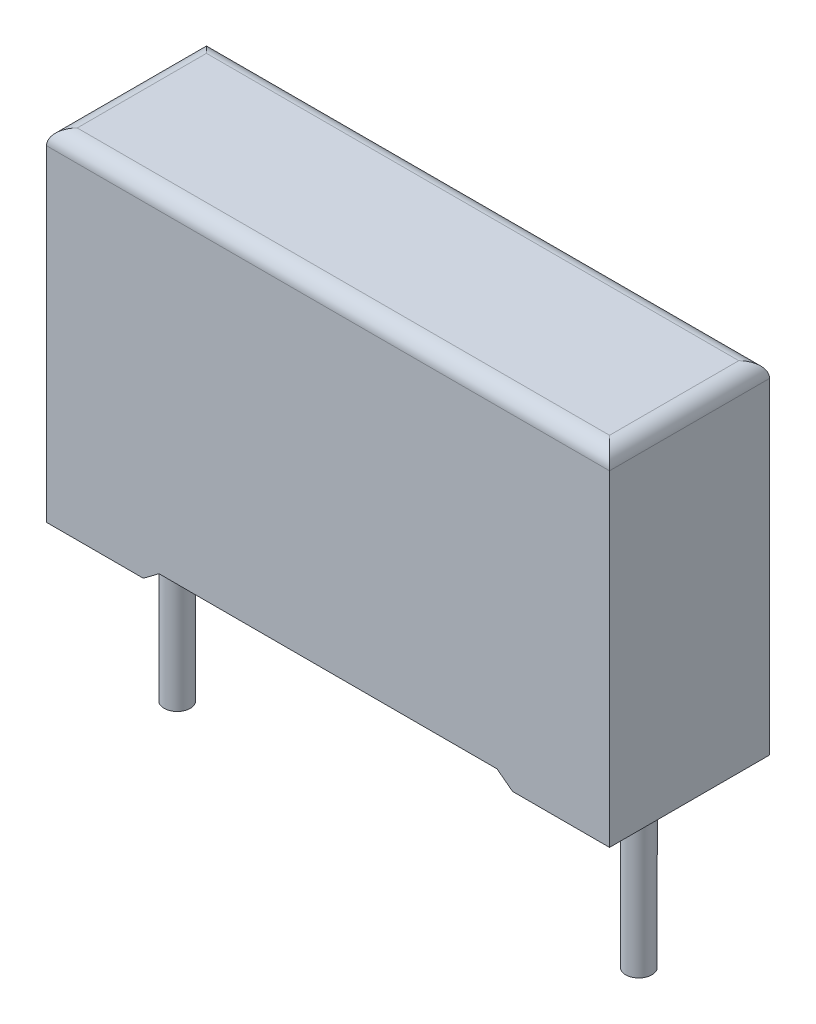
ISO-10303-21;
HEADER;
FILE_DESCRIPTION(('STEP AP214'),'2;1');
FILE_NAME('part.step','',(''),(''),'','','');
FILE_SCHEMA(('AUTOMOTIVE_DESIGN { 1 0 10303 214 1 1 1 1 }'));
ENDSEC;
DATA;
#1=APPLICATION_CONTEXT('core data for automotive mechanical design processes');
#2=APPLICATION_PROTOCOL_DEFINITION('international standard','automotive_design',2000,#1);
#3=PRODUCT_CONTEXT('',#1,'mechanical');
#4=PRODUCT('Part','Part','',(#3));
#5=PRODUCT_RELATED_PRODUCT_CATEGORY('part','',(#4));
#6=PRODUCT_DEFINITION_FORMATION('','',#4);
#7=PRODUCT_DEFINITION_CONTEXT('part definition',#1,'design');
#8=PRODUCT_DEFINITION('design','',#6,#7);
#9=PRODUCT_DEFINITION_SHAPE('','',#8);
#10=(LENGTH_UNIT() NAMED_UNIT(*) SI_UNIT(.MILLI.,.METRE.));
#11=(NAMED_UNIT(*) PLANE_ANGLE_UNIT() SI_UNIT($,.RADIAN.));
#12=(NAMED_UNIT(*) SI_UNIT($,.STERADIAN.) SOLID_ANGLE_UNIT());
#13=UNCERTAINTY_MEASURE_WITH_UNIT(LENGTH_MEASURE(1.E-05),#10,'distance_accuracy_value','');
#14=(GEOMETRIC_REPRESENTATION_CONTEXT(3) GLOBAL_UNCERTAINTY_ASSIGNED_CONTEXT((#13)) GLOBAL_UNIT_ASSIGNED_CONTEXT((#10,
#11,#12)) REPRESENTATION_CONTEXT('',''));
#15=CARTESIAN_POINT('',(0.,0.,0.));
#16=DIRECTION('',(0.,0.,1.));
#17=DIRECTION('',(1.,0.,0.));
#18=AXIS2_PLACEMENT_3D('',#15,#16,#17);
#19=CARTESIAN_POINT('',(16.65,-5.5,2.6));
#20=DIRECTION('',(0.,1.,0.));
#21=DIRECTION('',(0.,0.,1.));
#22=AXIS2_PLACEMENT_3D('',#19,#20,#21);
#23=CYLINDRICAL_SURFACE('',#22,0.425);
#24=CARTESIAN_POINT('',(16.65,-5.5,2.6));
#25=DIRECTION('',(0.,1.,0.));
#26=DIRECTION('',(0.,0.,-1.));
#27=AXIS2_PLACEMENT_3D('',#24,#25,#26);
#28=CIRCLE('',#27,0.425);
#29=CARTESIAN_POINT('',(16.65,-5.5,2.175));
#30=VERTEX_POINT('',#29);
#31=EDGE_CURVE('E11',#30,#30,#28,.T.);
#32=ORIENTED_EDGE('',*,*,#31,.T.);
#33=EDGE_LOOP('',(#32));
#34=FACE_BOUND('',#33,.T.);
#35=CARTESIAN_POINT('',(16.65,0.75,2.6));
#36=DIRECTION('',(0.,-1.,0.));
#37=DIRECTION('',(0.,0.,-1.));
#38=AXIS2_PLACEMENT_3D('',#35,#36,#37);
#39=CIRCLE('',#38,0.425);
#40=CARTESIAN_POINT('',(16.65,0.75,3.025));
#41=VERTEX_POINT('',#40);
#42=EDGE_CURVE('E28',#41,#41,#39,.T.);
#43=ORIENTED_EDGE('',*,*,#42,.T.);
#44=EDGE_LOOP('',(#43));
#45=FACE_BOUND('',#44,.T.);
#46=ADVANCED_FACE('F17',(#34,#45),#23,.T.);
#47=CARTESIAN_POINT('',(1.65,-5.5,2.6));
#48=DIRECTION('',(0.,1.,0.));
#49=DIRECTION('',(0.,0.,1.));
#50=AXIS2_PLACEMENT_3D('',#47,#48,#49);
#51=CYLINDRICAL_SURFACE('',#50,0.425);
#52=CARTESIAN_POINT('',(1.65,-5.5,2.6));
#53=DIRECTION('',(0.,-1.,0.));
#54=DIRECTION('',(0.,0.,-1.));
#55=AXIS2_PLACEMENT_3D('',#52,#53,#54);
#56=CIRCLE('',#55,0.425);
#57=CARTESIAN_POINT('',(1.65,-5.5,3.025));
#58=VERTEX_POINT('',#57);
#59=EDGE_CURVE('E357',#58,#58,#56,.T.);
#60=ORIENTED_EDGE('',*,*,#59,.F.);
#61=EDGE_LOOP('',(#60));
#62=FACE_BOUND('',#61,.T.);
#63=CARTESIAN_POINT('',(1.65,0.75,2.6));
#64=DIRECTION('',(0.,-1.,0.));
#65=DIRECTION('',(0.,0.,-1.));
#66=AXIS2_PLACEMENT_3D('',#63,#64,#65);
#67=CIRCLE('',#66,0.425);
#68=CARTESIAN_POINT('',(1.65,0.75,3.025));
#69=VERTEX_POINT('',#68);
#70=EDGE_CURVE('E21',#69,#69,#67,.T.);
#71=ORIENTED_EDGE('',*,*,#70,.T.);
#72=EDGE_LOOP('',(#71));
#73=FACE_BOUND('',#72,.T.);
#74=ADVANCED_FACE('F532',(#62,#73),#51,.T.);
#75=CARTESIAN_POINT('',(0.,0.,5.2));
#76=DIRECTION('',(0.,1.,0.));
#77=DIRECTION('',(1.,0.,0.));
#78=AXIS2_PLACEMENT_3D('',#75,#76,#77);
#79=PLANE('',#78);
#80=DIRECTION('',(0.,0.,1.));
#81=VECTOR('',#80,1.);
#82=CARTESIAN_POINT('',(15.15,0.,0.));
#83=LINE('',#82,#81);
#84=CARTESIAN_POINT('',(15.15,0.,0.));
#85=VERTEX_POINT('',#84);
#86=CARTESIAN_POINT('',(15.15,0.,0.609999939));
#87=VERTEX_POINT('',#86);
#88=EDGE_CURVE('E259',#85,#87,#83,.T.);
#89=ORIENTED_EDGE('',*,*,#88,.F.);
#90=DIRECTION('',(1.,0.,0.));
#91=VECTOR('',#90,1.);
#92=CARTESIAN_POINT('',(0.,0.,0.));
#93=LINE('',#92,#91);
#94=CARTESIAN_POINT('',(18.3,0.,0.));
#95=VERTEX_POINT('',#94);
#96=EDGE_CURVE('E309',#85,#95,#93,.T.);
#97=ORIENTED_EDGE('',*,*,#96,.T.);
#98=DIRECTION('',(0.,0.,-1.));
#99=VECTOR('',#98,1.);
#100=CARTESIAN_POINT('',(18.3,0.,5.2));
#101=LINE('',#100,#99);
#102=CARTESIAN_POINT('',(18.3,0.,5.2));
#103=VERTEX_POINT('',#102);
#104=EDGE_CURVE('E242',#103,#95,#101,.T.);
#105=ORIENTED_EDGE('',*,*,#104,.F.);
#106=DIRECTION('',(1.,0.,0.));
#107=VECTOR('',#106,1.);
#108=CARTESIAN_POINT('',(0.,0.,5.2));
#109=LINE('',#108,#107);
#110=CARTESIAN_POINT('',(15.15,0.,5.2));
#111=VERTEX_POINT('',#110);
#112=EDGE_CURVE('E169',#111,#103,#109,.T.);
#113=ORIENTED_EDGE('',*,*,#112,.F.);
#114=DIRECTION('',(0.,0.,1.));
#115=VECTOR('',#114,1.);
#116=CARTESIAN_POINT('',(15.15,0.,0.));
#117=LINE('',#116,#115);
#118=CARTESIAN_POINT('',(15.15,0.,4.590000061));
#119=VERTEX_POINT('',#118);
#120=EDGE_CURVE('E224',#119,#111,#117,.T.);
#121=ORIENTED_EDGE('',*,*,#120,.F.);
#122=DIRECTION('',(-1.,0.,0.));
#123=VECTOR('',#122,1.);
#124=CARTESIAN_POINT('',(17.690000061,0.,4.590000061));
#125=LINE('',#124,#123);
#126=CARTESIAN_POINT('',(17.690000061,0.,4.590000061));
#127=VERTEX_POINT('',#126);
#128=EDGE_CURVE('E272',#127,#119,#125,.T.);
#129=ORIENTED_EDGE('',*,*,#128,.F.);
#130=DIRECTION('',(0.,0.,1.));
#131=VECTOR('',#130,1.);
#132=CARTESIAN_POINT('',(17.690000061,0.,0.609999939));
#133=LINE('',#132,#131);
#134=CARTESIAN_POINT('',(17.690000061,0.,0.609999939));
#135=VERTEX_POINT('',#134);
#136=EDGE_CURVE('E215',#135,#127,#133,.T.);
#137=ORIENTED_EDGE('',*,*,#136,.F.);
#138=DIRECTION('',(1.,0.,0.));
#139=VECTOR('',#138,1.);
#140=CARTESIAN_POINT('',(0.609999939,0.,0.609999939));
#141=LINE('',#140,#139);
#142=EDGE_CURVE('E253',#87,#135,#141,.T.);
#143=ORIENTED_EDGE('',*,*,#142,.F.);
#144=EDGE_LOOP('',(#89,#97,#105,#113,#121,#129,#137,#143));
#145=FACE_BOUND('',#144,.T.);
#146=ADVANCED_FACE('F488',(#145),#79,.F.);
#147=CARTESIAN_POINT('',(0.,0.,5.2));
#148=DIRECTION('',(0.,0.,-1.));
#149=DIRECTION('',(0.,-1.,0.));
#150=AXIS2_PLACEMENT_3D('',#147,#148,#149);
#151=PLANE('',#150);
#152=DIRECTION('',(0.,1.,0.));
#153=VECTOR('',#152,1.);
#154=CARTESIAN_POINT('',(18.3,0.,5.2));
#155=LINE('',#154,#153);
#156=CARTESIAN_POINT('',(18.3,10.6,5.2));
#157=VERTEX_POINT('',#156);
#158=EDGE_CURVE('E295',#103,#157,#155,.T.);
#159=ORIENTED_EDGE('',*,*,#158,.T.);
#160=DIRECTION('',(-1.,0.,0.));
#161=VECTOR('',#160,1.);
#162=CARTESIAN_POINT('',(0.,10.6,5.2));
#163=LINE('',#162,#161);
#164=CARTESIAN_POINT('',(0.,10.6,5.2));
#165=VERTEX_POINT('',#164);
#166=EDGE_CURVE('E301',#157,#165,#163,.T.);
#167=ORIENTED_EDGE('',*,*,#166,.T.);
#168=DIRECTION('',(0.,-1.,0.));
#169=VECTOR('',#168,1.);
#170=CARTESIAN_POINT('',(0.,0.,5.2));
#171=LINE('',#170,#169);
#172=CARTESIAN_POINT('',(0.,0.,5.2));
#173=VERTEX_POINT('',#172);
#174=EDGE_CURVE('E153',#165,#173,#171,.T.);
#175=ORIENTED_EDGE('',*,*,#174,.T.);
#176=DIRECTION('',(1.,0.,0.));
#177=VECTOR('',#176,1.);
#178=CARTESIAN_POINT('',(0.,0.,5.2));
#179=LINE('',#178,#177);
#180=CARTESIAN_POINT('',(3.15,0.,5.2));
#181=VERTEX_POINT('',#180);
#182=EDGE_CURVE('E205',#173,#181,#179,.T.);
#183=ORIENTED_EDGE('',*,*,#182,.T.);
#184=DIRECTION('',(-0.798802732587283,-0.601593047176486,0.));
#185=VECTOR('',#184,1.);
#186=CARTESIAN_POINT('',(3.15,0.,5.2));
#187=LINE('',#186,#185);
#188=CARTESIAN_POINT('',(3.658191,0.382728,5.2));
#189=VERTEX_POINT('',#188);
#190=EDGE_CURVE('E230',#189,#181,#187,.T.);
#191=ORIENTED_EDGE('',*,*,#190,.F.);
#192=DIRECTION('',(-1.,0.,0.));
#193=VECTOR('',#192,1.);
#194=CARTESIAN_POINT('',(9.15,0.382728,5.2));
#195=LINE('',#194,#193);
#196=CARTESIAN_POINT('',(14.641809,0.382728,5.2));
#197=VERTEX_POINT('',#196);
#198=EDGE_CURVE('E231',#197,#189,#195,.T.);
#199=ORIENTED_EDGE('',*,*,#198,.F.);
#200=DIRECTION('',(0.798802732587283,-0.601593047176486,0.));
#201=VECTOR('',#200,1.);
#202=CARTESIAN_POINT('',(15.15,0.,5.2));
#203=LINE('',#202,#201);
#204=EDGE_CURVE('E209',#197,#111,#203,.T.);
#205=ORIENTED_EDGE('',*,*,#204,.T.);
#206=ORIENTED_EDGE('',*,*,#112,.T.);
#207=EDGE_LOOP('',(#159,#167,#175,#183,#191,#199,#205,#206));
#208=FACE_BOUND('',#207,.T.);
#209=ADVANCED_FACE('F306',(#208),#151,.F.);
#210=CARTESIAN_POINT('',(0.,0.,0.));
#211=DIRECTION('',(0.,0.,-1.));
#212=DIRECTION('',(0.,-1.,0.));
#213=AXIS2_PLACEMENT_3D('',#210,#211,#212);
#214=PLANE('',#213);
#215=DIRECTION('',(0.,-1.,0.));
#216=VECTOR('',#215,1.);
#217=CARTESIAN_POINT('',(0.,0.,0.));
#218=LINE('',#217,#216);
#219=CARTESIAN_POINT('',(0.,10.6,0.));
#220=VERTEX_POINT('',#219);
#221=CARTESIAN_POINT('',(0.,0.,0.));
#222=VERTEX_POINT('',#221);
#223=EDGE_CURVE('E133',#220,#222,#218,.T.);
#224=ORIENTED_EDGE('',*,*,#223,.F.);
#225=DIRECTION('',(1.,0.,0.));
#226=VECTOR('',#225,1.);
#227=CARTESIAN_POINT('',(18.3,10.6,0.));
#228=LINE('',#227,#226);
#229=CARTESIAN_POINT('',(18.3,10.6,0.));
#230=VERTEX_POINT('',#229);
#231=EDGE_CURVE('E138',#220,#230,#228,.T.);
#232=ORIENTED_EDGE('',*,*,#231,.T.);
#233=DIRECTION('',(0.,1.,0.));
#234=VECTOR('',#233,1.);
#235=CARTESIAN_POINT('',(18.3,0.,0.));
#236=LINE('',#235,#234);
#237=EDGE_CURVE('E148',#95,#230,#236,.T.);
#238=ORIENTED_EDGE('',*,*,#237,.F.);
#239=ORIENTED_EDGE('',*,*,#96,.F.);
#240=DIRECTION('',(0.798802732587283,-0.601593047176486,0.));
#241=VECTOR('',#240,1.);
#242=CARTESIAN_POINT('',(15.15,0.,0.));
#243=LINE('',#242,#241);
#244=CARTESIAN_POINT('',(14.641809,0.382728,0.));
#245=VERTEX_POINT('',#244);
#246=EDGE_CURVE('E225',#245,#85,#243,.T.);
#247=ORIENTED_EDGE('',*,*,#246,.F.);
#248=DIRECTION('',(-1.,0.,0.));
#249=VECTOR('',#248,1.);
#250=CARTESIAN_POINT('',(9.15,0.382728,0.));
#251=LINE('',#250,#249);
#252=CARTESIAN_POINT('',(3.658191,0.382728,0.));
#253=VERTEX_POINT('',#252);
#254=EDGE_CURVE('E170',#245,#253,#251,.T.);
#255=ORIENTED_EDGE('',*,*,#254,.T.);
#256=DIRECTION('',(-0.798802732587283,-0.601593047176486,0.));
#257=VECTOR('',#256,1.);
#258=CARTESIAN_POINT('',(3.15,0.,0.));
#259=LINE('',#258,#257);
#260=CARTESIAN_POINT('',(3.15,0.,0.));
#261=VERTEX_POINT('',#260);
#262=EDGE_CURVE('E198',#253,#261,#259,.T.);
#263=ORIENTED_EDGE('',*,*,#262,.T.);
#264=DIRECTION('',(1.,0.,0.));
#265=VECTOR('',#264,1.);
#266=CARTESIAN_POINT('',(0.,0.,0.));
#267=LINE('',#266,#265);
#268=EDGE_CURVE('E142',#222,#261,#267,.T.);
#269=ORIENTED_EDGE('',*,*,#268,.F.);
#270=EDGE_LOOP('',(#224,#232,#238,#239,#247,#255,#263,#269));
#271=FACE_BOUND('',#270,.T.);
#272=ADVANCED_FACE('F135',(#271),#214,.T.);
#273=CARTESIAN_POINT('',(17.690000061,0.75,4.590000061));
#274=DIRECTION('',(0.,0.,1.));
#275=DIRECTION('',(1.,0.,0.));
#276=AXIS2_PLACEMENT_3D('',#273,#274,#275);
#277=PLANE('',#276);
#278=DIRECTION('',(0.798802732587283,-0.601593047176486,0.));
#279=VECTOR('',#278,1.);
#280=CARTESIAN_POINT('',(16.4103223576265,-0.949171975280309,4.590000061));
#281=LINE('',#280,#279);
#282=CARTESIAN_POINT('',(14.641809,0.382728,4.590000061));
#283=VERTEX_POINT('',#282);
#284=EDGE_CURVE('E353',#283,#119,#281,.T.);
#285=ORIENTED_EDGE('',*,*,#284,.F.);
#286=DIRECTION('',(-1.,0.,0.));
#287=VECTOR('',#286,1.);
#288=CARTESIAN_POINT('',(17.690000061,0.382728,4.590000061));
#289=LINE('',#288,#287);
#290=CARTESIAN_POINT('',(3.658191,0.382728,4.590000061));
#291=VERTEX_POINT('',#290);
#292=EDGE_CURVE('E192',#283,#291,#289,.T.);
#293=ORIENTED_EDGE('',*,*,#292,.T.);
#294=DIRECTION('',(-0.798802732587283,-0.601593047176486,0.));
#295=VECTOR('',#294,1.);
#296=CARTESIAN_POINT('',(12.7881832796786,7.25869330677799,4.590000061));
#297=LINE('',#296,#295);
#298=CARTESIAN_POINT('',(3.15,0.,4.590000061));
#299=VERTEX_POINT('',#298);
#300=EDGE_CURVE('E199',#291,#299,#297,.T.);
#301=ORIENTED_EDGE('',*,*,#300,.T.);
#302=DIRECTION('',(-1.,0.,0.));
#303=VECTOR('',#302,1.);
#304=CARTESIAN_POINT('',(17.690000061,0.,4.590000061));
#305=LINE('',#304,#303);
#306=CARTESIAN_POINT('',(0.609999939,0.,4.590000061));
#307=VERTEX_POINT('',#306);
#308=EDGE_CURVE('E329',#299,#307,#305,.T.);
#309=ORIENTED_EDGE('',*,*,#308,.T.);
#310=DIRECTION('',(0.,-1.,0.));
#311=VECTOR('',#310,1.);
#312=CARTESIAN_POINT('',(0.609999939,0.75,4.590000061));
#313=LINE('',#312,#311);
#314=CARTESIAN_POINT('',(0.609999939,0.75,4.590000061));
#315=VERTEX_POINT('',#314);
#316=EDGE_CURVE('E210',#315,#307,#313,.T.);
#317=ORIENTED_EDGE('',*,*,#316,.F.);
#318=DIRECTION('',(-1.,0.,0.));
#319=VECTOR('',#318,1.);
#320=CARTESIAN_POINT('',(17.690000061,0.75,4.590000061));
#321=LINE('',#320,#319);
#322=CARTESIAN_POINT('',(17.690000061,0.75,4.590000061));
#323=VERTEX_POINT('',#322);
#324=EDGE_CURVE('E200',#323,#315,#321,.T.);
#325=ORIENTED_EDGE('',*,*,#324,.F.);
#326=DIRECTION('',(0.,-1.,0.));
#327=VECTOR('',#326,1.);
#328=CARTESIAN_POINT('',(17.690000061,0.75,4.590000061));
#329=LINE('',#328,#327);
#330=EDGE_CURVE('E333',#323,#127,#329,.T.);
#331=ORIENTED_EDGE('',*,*,#330,.T.);
#332=ORIENTED_EDGE('',*,*,#128,.T.);
#333=EDGE_LOOP('',(#285,#293,#301,#309,#317,#325,#331,#332));
#334=FACE_BOUND('',#333,.T.);
#335=ADVANCED_FACE('F519',(#334),#277,.F.);
#336=CARTESIAN_POINT('',(0.609999939,0.75,0.609999939));
#337=DIRECTION('',(0.,0.,-1.));
#338=DIRECTION('',(-1.,0.,0.));
#339=AXIS2_PLACEMENT_3D('',#336,#337,#338);
#340=PLANE('',#339);
#341=DIRECTION('',(1.,0.,0.));
#342=VECTOR('',#341,1.);
#343=CARTESIAN_POINT('',(0.609999939,0.382728,0.609999939));
#344=LINE('',#343,#342);
#345=CARTESIAN_POINT('',(3.658191,0.382728,0.609999939));
#346=VERTEX_POINT('',#345);
#347=CARTESIAN_POINT('',(14.641809,0.382728,0.609999939));
#348=VERTEX_POINT('',#347);
#349=EDGE_CURVE('E257',#346,#348,#344,.T.);
#350=ORIENTED_EDGE('',*,*,#349,.T.);
#351=DIRECTION('',(-0.798802732587283,0.601593047176486,0.));
#352=VECTOR('',#351,1.);
#353=CARTESIAN_POINT('',(5.51181672032144,7.25869330677799,0.609999939));
#354=LINE('',#353,#352);
#355=EDGE_CURVE('E221',#87,#348,#354,.T.);
#356=ORIENTED_EDGE('',*,*,#355,.F.);
#357=ORIENTED_EDGE('',*,*,#142,.T.);
#358=DIRECTION('',(0.,-1.,0.));
#359=VECTOR('',#358,1.);
#360=CARTESIAN_POINT('',(17.690000061,0.75,0.609999939));
#361=LINE('',#360,#359);
#362=CARTESIAN_POINT('',(17.690000061,0.75,0.609999939));
#363=VERTEX_POINT('',#362);
#364=EDGE_CURVE('E280',#363,#135,#361,.T.);
#365=ORIENTED_EDGE('',*,*,#364,.F.);
#366=DIRECTION('',(1.,0.,0.));
#367=VECTOR('',#366,1.);
#368=CARTESIAN_POINT('',(0.609999939,0.75,0.609999939));
#369=LINE('',#368,#367);
#370=CARTESIAN_POINT('',(0.609999939,0.75,0.609999939));
#371=VERTEX_POINT('',#370);
#372=EDGE_CURVE('E368',#371,#363,#369,.T.);
#373=ORIENTED_EDGE('',*,*,#372,.F.);
#374=DIRECTION('',(0.,-1.,0.));
#375=VECTOR('',#374,1.);
#376=CARTESIAN_POINT('',(0.609999939,0.75,0.609999939));
#377=LINE('',#376,#375);
#378=CARTESIAN_POINT('',(0.609999939,0.,0.609999939));
#379=VERTEX_POINT('',#378);
#380=EDGE_CURVE('E258',#371,#379,#377,.T.);
#381=ORIENTED_EDGE('',*,*,#380,.T.);
#382=DIRECTION('',(1.,0.,0.));
#383=VECTOR('',#382,1.);
#384=CARTESIAN_POINT('',(0.609999939,0.,0.609999939));
#385=LINE('',#384,#383);
#386=CARTESIAN_POINT('',(3.15,0.,0.609999939));
#387=VERTEX_POINT('',#386);
#388=EDGE_CURVE('E219',#379,#387,#385,.T.);
#389=ORIENTED_EDGE('',*,*,#388,.T.);
#390=DIRECTION('',(0.798802732587283,0.601593047176486,0.));
#391=VECTOR('',#390,1.);
#392=CARTESIAN_POINT('',(1.8896776423735,-0.949171975280309,0.609999939));
#393=LINE('',#392,#391);
#394=EDGE_CURVE('E216',#387,#346,#393,.T.);
#395=ORIENTED_EDGE('',*,*,#394,.T.);
#396=EDGE_LOOP('',(#350,#356,#357,#365,#373,#381,#389,#395));
#397=FACE_BOUND('',#396,.T.);
#398=ADVANCED_FACE('F522',(#397),#340,.F.);
#399=CARTESIAN_POINT('',(0.,0.75,0.));
#400=DIRECTION('',(0.,-1.,0.));
#401=DIRECTION('',(0.,0.,-1.));
#402=AXIS2_PLACEMENT_3D('',#399,#400,#401);
#403=PLANE('',#402);
#404=DIRECTION('',(0.,0.,-1.));
#405=VECTOR('',#404,1.);
#406=CARTESIAN_POINT('',(0.609999939,0.75,4.590000061));
#407=LINE('',#406,#405);
#408=EDGE_CURVE('E220',#315,#371,#407,.T.);
#409=ORIENTED_EDGE('',*,*,#408,.T.);
#410=ORIENTED_EDGE('',*,*,#372,.T.);
#411=DIRECTION('',(0.,0.,1.));
#412=VECTOR('',#411,1.);
#413=CARTESIAN_POINT('',(17.690000061,0.75,0.609999939));
#414=LINE('',#413,#412);
#415=EDGE_CURVE('E204',#363,#323,#414,.T.);
#416=ORIENTED_EDGE('',*,*,#415,.T.);
#417=ORIENTED_EDGE('',*,*,#324,.T.);
#418=EDGE_LOOP('',(#409,#410,#416,#417));
#419=FACE_BOUND('',#418,.T.);
#420=ORIENTED_EDGE('',*,*,#42,.F.);
#421=EDGE_LOOP('',(#420));
#422=FACE_BOUND('',#421,.T.);
#423=ORIENTED_EDGE('',*,*,#70,.F.);
#424=EDGE_LOOP('',(#423));
#425=FACE_BOUND('',#424,.T.);
#426=ADVANCED_FACE('F418',(#419,#422,#425),#403,.T.);
#427=CARTESIAN_POINT('',(0.,0.,5.2));
#428=DIRECTION('',(0.,1.,0.));
#429=DIRECTION('',(1.,0.,0.));
#430=AXIS2_PLACEMENT_3D('',#427,#428,#429);
#431=PLANE('',#430);
#432=ORIENTED_EDGE('',*,*,#268,.T.);
#433=DIRECTION('',(0.,0.,1.));
#434=VECTOR('',#433,1.);
#435=CARTESIAN_POINT('',(3.15,0.,0.));
#436=LINE('',#435,#434);
#437=EDGE_CURVE('E276',#261,#387,#436,.T.);
#438=ORIENTED_EDGE('',*,*,#437,.T.);
#439=ORIENTED_EDGE('',*,*,#388,.F.);
#440=DIRECTION('',(0.,0.,-1.));
#441=VECTOR('',#440,1.);
#442=CARTESIAN_POINT('',(0.609999939,0.,4.590000061));
#443=LINE('',#442,#441);
#444=EDGE_CURVE('E214',#307,#379,#443,.T.);
#445=ORIENTED_EDGE('',*,*,#444,.F.);
#446=ORIENTED_EDGE('',*,*,#308,.F.);
#447=DIRECTION('',(0.,0.,1.));
#448=VECTOR('',#447,1.);
#449=CARTESIAN_POINT('',(3.15,0.,0.));
#450=LINE('',#449,#448);
#451=EDGE_CURVE('E268',#299,#181,#450,.T.);
#452=ORIENTED_EDGE('',*,*,#451,.T.);
#453=ORIENTED_EDGE('',*,*,#182,.F.);
#454=DIRECTION('',(0.,0.,-1.));
#455=VECTOR('',#454,1.);
#456=CARTESIAN_POINT('',(0.,0.,5.2));
#457=LINE('',#456,#455);
#458=EDGE_CURVE('E159',#173,#222,#457,.T.);
#459=ORIENTED_EDGE('',*,*,#458,.T.);
#460=EDGE_LOOP('',(#432,#438,#439,#445,#446,#452,#453,#459));
#461=FACE_BOUND('',#460,.T.);
#462=ADVANCED_FACE('F503',(#461),#431,.F.);
#463=CARTESIAN_POINT('',(0.,0.,5.2));
#464=DIRECTION('',(1.,0.,0.));
#465=DIRECTION('',(0.,1.,0.));
#466=AXIS2_PLACEMENT_3D('',#463,#464,#465);
#467=PLANE('',#466);
#468=ORIENTED_EDGE('',*,*,#174,.F.);
#469=DIRECTION('',(0.,0.,-1.));
#470=VECTOR('',#469,1.);
#471=CARTESIAN_POINT('',(0.,10.6,5.2));
#472=LINE('',#471,#470);
#473=EDGE_CURVE('E147',#165,#220,#472,.T.);
#474=ORIENTED_EDGE('',*,*,#473,.T.);
#475=ORIENTED_EDGE('',*,*,#223,.T.);
#476=ORIENTED_EDGE('',*,*,#458,.F.);
#477=EDGE_LOOP('',(#468,#474,#475,#476));
#478=FACE_BOUND('',#477,.T.);
#479=ADVANCED_FACE('F151',(#478),#467,.F.);
#480=CARTESIAN_POINT('',(18.3,0.,5.2));
#481=DIRECTION('',(-1.,0.,0.));
#482=DIRECTION('',(0.,0.,1.));
#483=AXIS2_PLACEMENT_3D('',#480,#481,#482);
#484=PLANE('',#483);
#485=ORIENTED_EDGE('',*,*,#237,.T.);
#486=DIRECTION('',(0.,0.,1.));
#487=VECTOR('',#486,1.);
#488=CARTESIAN_POINT('',(18.3,10.6,5.2));
#489=LINE('',#488,#487);
#490=EDGE_CURVE('E190',#230,#157,#489,.T.);
#491=ORIENTED_EDGE('',*,*,#490,.T.);
#492=ORIENTED_EDGE('',*,*,#158,.F.);
#493=ORIENTED_EDGE('',*,*,#104,.T.);
#494=EDGE_LOOP('',(#485,#491,#492,#493));
#495=FACE_BOUND('',#494,.T.);
#496=ADVANCED_FACE('F293',(#495),#484,.F.);
#497=CARTESIAN_POINT('',(0.,11.1,5.2));
#498=DIRECTION('',(0.,-1.,0.));
#499=DIRECTION('',(0.,0.,-1.));
#500=AXIS2_PLACEMENT_3D('',#497,#498,#499);
#501=PLANE('',#500);
#502=DIRECTION('',(-1.,0.,0.));
#503=VECTOR('',#502,1.);
#504=CARTESIAN_POINT('',(0.,11.1,0.5));
#505=LINE('',#504,#503);
#506=CARTESIAN_POINT('',(17.8,11.1,0.5));
#507=VERTEX_POINT('',#506);
#508=CARTESIAN_POINT('',(0.5,11.1,0.5));
#509=VERTEX_POINT('',#508);
#510=EDGE_CURVE('E249',#507,#509,#505,.T.);
#511=ORIENTED_EDGE('',*,*,#510,.T.);
#512=DIRECTION('',(0.,0.,1.));
#513=VECTOR('',#512,1.);
#514=CARTESIAN_POINT('',(0.5,11.1,5.2));
#515=LINE('',#514,#513);
#516=CARTESIAN_POINT('',(0.5,11.1,4.7));
#517=VERTEX_POINT('',#516);
#518=EDGE_CURVE('E175',#509,#517,#515,.T.);
#519=ORIENTED_EDGE('',*,*,#518,.T.);
#520=DIRECTION('',(1.,0.,0.));
#521=VECTOR('',#520,1.);
#522=CARTESIAN_POINT('',(0.,11.1,4.7));
#523=LINE('',#522,#521);
#524=CARTESIAN_POINT('',(17.8,11.1,4.7));
#525=VERTEX_POINT('',#524);
#526=EDGE_CURVE('E238',#517,#525,#523,.T.);
#527=ORIENTED_EDGE('',*,*,#526,.T.);
#528=DIRECTION('',(0.,0.,-1.));
#529=VECTOR('',#528,1.);
#530=CARTESIAN_POINT('',(17.8,11.1,5.2));
#531=LINE('',#530,#529);
#532=EDGE_CURVE('E235',#525,#507,#531,.T.);
#533=ORIENTED_EDGE('',*,*,#532,.T.);
#534=EDGE_LOOP('',(#511,#519,#527,#533));
#535=FACE_BOUND('',#534,.T.);
#536=ADVANCED_FACE('F553',(#535),#501,.F.);
#537=CARTESIAN_POINT('',(0.609999939,0.75,4.590000061));
#538=DIRECTION('',(-1.,0.,0.));
#539=DIRECTION('',(0.,0.,1.));
#540=AXIS2_PLACEMENT_3D('',#537,#538,#539);
#541=PLANE('',#540);
#542=ORIENTED_EDGE('',*,*,#444,.T.);
#543=ORIENTED_EDGE('',*,*,#380,.F.);
#544=ORIENTED_EDGE('',*,*,#408,.F.);
#545=ORIENTED_EDGE('',*,*,#316,.T.);
#546=EDGE_LOOP('',(#542,#543,#544,#545));
#547=FACE_BOUND('',#546,.T.);
#548=ADVANCED_FACE('F521',(#547),#541,.F.);
#549=CARTESIAN_POINT('',(17.690000061,0.75,0.609999939));
#550=DIRECTION('',(1.,0.,0.));
#551=DIRECTION('',(0.,1.,0.));
#552=AXIS2_PLACEMENT_3D('',#549,#550,#551);
#553=PLANE('',#552);
#554=ORIENTED_EDGE('',*,*,#136,.T.);
#555=ORIENTED_EDGE('',*,*,#330,.F.);
#556=ORIENTED_EDGE('',*,*,#415,.F.);
#557=ORIENTED_EDGE('',*,*,#364,.T.);
#558=EDGE_LOOP('',(#554,#555,#556,#557));
#559=FACE_BOUND('',#558,.T.);
#560=ADVANCED_FACE('F427',(#559),#553,.F.);
#561=CARTESIAN_POINT('',(9.15,0.382728,0.));
#562=DIRECTION('',(0.,1.,0.));
#563=DIRECTION('',(1.,0.,0.));
#564=AXIS2_PLACEMENT_3D('',#561,#562,#563);
#565=PLANE('',#564);
#566=DIRECTION('',(0.,0.,1.));
#567=VECTOR('',#566,1.);
#568=CARTESIAN_POINT('',(3.658191,0.382728,0.));
#569=LINE('',#568,#567);
#570=EDGE_CURVE('E281',#253,#346,#569,.T.);
#571=ORIENTED_EDGE('',*,*,#570,.F.);
#572=ORIENTED_EDGE('',*,*,#254,.F.);
#573=DIRECTION('',(0.,0.,1.));
#574=VECTOR('',#573,1.);
#575=CARTESIAN_POINT('',(14.641809,0.382728,0.));
#576=LINE('',#575,#574);
#577=EDGE_CURVE('E277',#245,#348,#576,.T.);
#578=ORIENTED_EDGE('',*,*,#577,.T.);
#579=ORIENTED_EDGE('',*,*,#349,.F.);
#580=EDGE_LOOP('',(#571,#572,#578,#579));
#581=FACE_BOUND('',#580,.T.);
#582=ADVANCED_FACE('F498',(#581),#565,.F.);
#583=CARTESIAN_POINT('',(3.15,0.,0.));
#584=DIRECTION('',(-0.601593047176486,0.798802732587283,0.));
#585=DIRECTION('',(0.,0.,1.));
#586=AXIS2_PLACEMENT_3D('',#583,#584,#585);
#587=PLANE('',#586);
#588=ORIENTED_EDGE('',*,*,#437,.F.);
#589=ORIENTED_EDGE('',*,*,#262,.F.);
#590=ORIENTED_EDGE('',*,*,#570,.T.);
#591=ORIENTED_EDGE('',*,*,#394,.F.);
#592=EDGE_LOOP('',(#588,#589,#590,#591));
#593=FACE_BOUND('',#592,.T.);
#594=ADVANCED_FACE('F501',(#593),#587,.F.);
#595=CARTESIAN_POINT('',(3.15,0.,0.));
#596=DIRECTION('',(-0.601593047176486,0.798802732587283,0.));
#597=DIRECTION('',(0.,0.,1.));
#598=AXIS2_PLACEMENT_3D('',#595,#596,#597);
#599=PLANE('',#598);
#600=DIRECTION('',(0.,0.,1.));
#601=VECTOR('',#600,1.);
#602=CARTESIAN_POINT('',(3.658191,0.382728,0.));
#603=LINE('',#602,#601);
#604=EDGE_CURVE('E343',#291,#189,#603,.T.);
#605=ORIENTED_EDGE('',*,*,#604,.T.);
#606=ORIENTED_EDGE('',*,*,#190,.T.);
#607=ORIENTED_EDGE('',*,*,#451,.F.);
#608=ORIENTED_EDGE('',*,*,#300,.F.);
#609=EDGE_LOOP('',(#605,#606,#607,#608));
#610=FACE_BOUND('',#609,.T.);
#611=ADVANCED_FACE('F510',(#610),#599,.F.);
#612=CARTESIAN_POINT('',(9.15,0.382728,0.));
#613=DIRECTION('',(0.,1.,0.));
#614=DIRECTION('',(1.,0.,0.));
#615=AXIS2_PLACEMENT_3D('',#612,#613,#614);
#616=PLANE('',#615);
#617=ORIENTED_EDGE('',*,*,#292,.F.);
#618=DIRECTION('',(0.,0.,1.));
#619=VECTOR('',#618,1.);
#620=CARTESIAN_POINT('',(14.641809,0.382728,0.));
#621=LINE('',#620,#619);
#622=EDGE_CURVE('E226',#283,#197,#621,.T.);
#623=ORIENTED_EDGE('',*,*,#622,.T.);
#624=ORIENTED_EDGE('',*,*,#198,.T.);
#625=ORIENTED_EDGE('',*,*,#604,.F.);
#626=EDGE_LOOP('',(#617,#623,#624,#625));
#627=FACE_BOUND('',#626,.T.);
#628=ADVANCED_FACE('F513',(#627),#616,.F.);
#629=CARTESIAN_POINT('',(1.65,-5.5,2.6));
#630=DIRECTION('',(0.,-1.,0.));
#631=DIRECTION('',(0.,0.,-1.));
#632=AXIS2_PLACEMENT_3D('',#629,#630,#631);
#633=PLANE('',#632);
#634=ORIENTED_EDGE('',*,*,#59,.T.);
#635=EDGE_LOOP('',(#634));
#636=FACE_BOUND('',#635,.T.);
#637=ADVANCED_FACE('F19',(#636),#633,.T.);
#638=CARTESIAN_POINT('',(15.15,0.,0.));
#639=DIRECTION('',(-0.601593047176486,-0.798802732587283,0.));
#640=DIRECTION('',(-0.798802732587283,0.601593047176486,0.));
#641=AXIS2_PLACEMENT_3D('',#638,#639,#640);
#642=PLANE('',#641);
#643=ORIENTED_EDGE('',*,*,#284,.T.);
#644=ORIENTED_EDGE('',*,*,#120,.T.);
#645=ORIENTED_EDGE('',*,*,#204,.F.);
#646=ORIENTED_EDGE('',*,*,#622,.F.);
#647=EDGE_LOOP('',(#643,#644,#645,#646));
#648=FACE_BOUND('',#647,.T.);
#649=ADVANCED_FACE('F516',(#648),#642,.T.);
#650=CARTESIAN_POINT('',(15.15,0.,0.));
#651=DIRECTION('',(-0.601593047176486,-0.798802732587283,0.));
#652=DIRECTION('',(-0.798802732587283,0.601593047176486,0.));
#653=AXIS2_PLACEMENT_3D('',#650,#651,#652);
#654=PLANE('',#653);
#655=ORIENTED_EDGE('',*,*,#355,.T.);
#656=ORIENTED_EDGE('',*,*,#577,.F.);
#657=ORIENTED_EDGE('',*,*,#246,.T.);
#658=ORIENTED_EDGE('',*,*,#88,.T.);
#659=EDGE_LOOP('',(#655,#656,#657,#658));
#660=FACE_BOUND('',#659,.T.);
#661=ADVANCED_FACE('F493',(#660),#654,.T.);
#662=CARTESIAN_POINT('',(16.65,-5.5,2.6));
#663=DIRECTION('',(0.,-1.,0.));
#664=DIRECTION('',(0.,0.,-1.));
#665=AXIS2_PLACEMENT_3D('',#662,#663,#664);
#666=PLANE('',#665);
#667=ORIENTED_EDGE('',*,*,#31,.F.);
#668=EDGE_LOOP('',(#667));
#669=FACE_BOUND('',#668,.T.);
#670=ADVANCED_FACE('F548',(#669),#666,.T.);
#671=CARTESIAN_POINT('',(17.8,10.6,5.2));
#672=DIRECTION('',(0.,0.,-1.));
#673=DIRECTION('',(-1.,0.,0.));
#674=AXIS2_PLACEMENT_3D('',#671,#672,#673);
#675=CYLINDRICAL_SURFACE('',#674,0.5);
#676=CARTESIAN_POINT('',(17.8,11.1,0.5));
#677=CARTESIAN_POINT('',(18.0928932188134,11.1,0.207106781186548));
#678=CARTESIAN_POINT('',(18.3,10.8928932188135,0.));
#679=CARTESIAN_POINT('',(18.3,10.6,0.));
#680=(BOUNDED_CURVE() B_SPLINE_CURVE(3,(#676,#677,#678,#679),.UNSPECIFIED.,.F.,
.F.) B_SPLINE_CURVE_WITH_KNOTS((4,4),(4.71238898038469,6.28318530717959),
.UNSPECIFIED.) CURVE() GEOMETRIC_REPRESENTATION_ITEM() RATIONAL_B_SPLINE_CURVE((1.,
0.804737854124365,0.804737854124365,1.)) REPRESENTATION_ITEM(''));
#681=EDGE_CURVE('E167',#507,#230,#680,.T.);
#682=ORIENTED_EDGE('',*,*,#681,.F.);
#683=ORIENTED_EDGE('',*,*,#532,.F.);
#684=CARTESIAN_POINT('',(18.3,10.6,5.2));
#685=CARTESIAN_POINT('',(18.3,10.8928932188135,5.2));
#686=CARTESIAN_POINT('',(18.0928932188134,11.1,4.99289321881345));
#687=CARTESIAN_POINT('',(17.8,11.1,4.7));
#688=(BOUNDED_CURVE() B_SPLINE_CURVE(3,(#684,#685,#686,#687),.UNSPECIFIED.,.F.,
.F.) B_SPLINE_CURVE_WITH_KNOTS((4,4),(3.1415926535898,4.71238898038469),
.UNSPECIFIED.) CURVE() GEOMETRIC_REPRESENTATION_ITEM() RATIONAL_B_SPLINE_CURVE((1.,
0.804737854124365,0.804737854124365,1.)) REPRESENTATION_ITEM(''));
#689=EDGE_CURVE('E262',#157,#525,#688,.T.);
#690=ORIENTED_EDGE('',*,*,#689,.F.);
#691=ORIENTED_EDGE('',*,*,#490,.F.);
#692=EDGE_LOOP('',(#682,#683,#690,#691));
#693=FACE_BOUND('',#692,.T.);
#694=ADVANCED_FACE('F312',(#693),#675,.T.);
#695=CARTESIAN_POINT('',(0.,10.6,4.7));
#696=DIRECTION('',(-1.,0.,0.));
#697=DIRECTION('',(0.,0.,1.));
#698=AXIS2_PLACEMENT_3D('',#695,#696,#697);
#699=CYLINDRICAL_SURFACE('',#698,0.5);
#700=ORIENTED_EDGE('',*,*,#689,.T.);
#701=ORIENTED_EDGE('',*,*,#526,.F.);
#702=CARTESIAN_POINT('',(0.,10.6,5.2));
#703=CARTESIAN_POINT('',(0.,10.8928932188135,5.2));
#704=CARTESIAN_POINT('',(0.207106781186547,11.1,4.99289321881345));
#705=CARTESIAN_POINT('',(0.5,11.1,4.7));
#706=(BOUNDED_CURVE() B_SPLINE_CURVE(3,(#702,#703,#704,#705),.UNSPECIFIED.,.F.,
.F.) B_SPLINE_CURVE_WITH_KNOTS((4,4),(0.,1.5707963267949),
.UNSPECIFIED.) CURVE() GEOMETRIC_REPRESENTATION_ITEM() RATIONAL_B_SPLINE_CURVE((1.,
0.804737854124365,0.804737854124365,1.)) REPRESENTATION_ITEM(''));
#707=EDGE_CURVE('E178',#165,#517,#706,.T.);
#708=ORIENTED_EDGE('',*,*,#707,.F.);
#709=ORIENTED_EDGE('',*,*,#166,.F.);
#710=EDGE_LOOP('',(#700,#701,#708,#709));
#711=FACE_BOUND('',#710,.T.);
#712=ADVANCED_FACE('F302',(#711),#699,.T.);
#713=CARTESIAN_POINT('',(0.,10.6,0.5));
#714=DIRECTION('',(1.,0.,0.));
#715=DIRECTION('',(0.,0.,-1.));
#716=AXIS2_PLACEMENT_3D('',#713,#714,#715);
#717=CYLINDRICAL_SURFACE('',#716,0.5);
#718=ORIENTED_EDGE('',*,*,#681,.T.);
#719=ORIENTED_EDGE('',*,*,#231,.F.);
#720=CARTESIAN_POINT('',(0.5,11.1,0.5));
#721=CARTESIAN_POINT('',(0.207106781186547,11.1,0.207106781186548));
#722=CARTESIAN_POINT('',(0.,10.8928932188135,0.));
#723=CARTESIAN_POINT('',(0.,10.6,0.));
#724=(BOUNDED_CURVE() B_SPLINE_CURVE(3,(#720,#721,#722,#723),.UNSPECIFIED.,.F.,
.F.) B_SPLINE_CURVE_WITH_KNOTS((4,4),(1.5707963267949,3.1415926535898),
.UNSPECIFIED.) CURVE() GEOMETRIC_REPRESENTATION_ITEM() RATIONAL_B_SPLINE_CURVE((1.,
0.804737854124365,0.804737854124365,1.)) REPRESENTATION_ITEM(''));
#725=EDGE_CURVE('E165',#509,#220,#724,.T.);
#726=ORIENTED_EDGE('',*,*,#725,.F.);
#727=ORIENTED_EDGE('',*,*,#510,.F.);
#728=EDGE_LOOP('',(#718,#719,#726,#727));
#729=FACE_BOUND('',#728,.T.);
#730=ADVANCED_FACE('F163',(#729),#717,.T.);
#731=CARTESIAN_POINT('',(0.5,10.6,5.2));
#732=DIRECTION('',(0.,0.,-1.));
#733=DIRECTION('',(-1.,0.,0.));
#734=AXIS2_PLACEMENT_3D('',#731,#732,#733);
#735=CYLINDRICAL_SURFACE('',#734,0.5);
#736=ORIENTED_EDGE('',*,*,#707,.T.);
#737=ORIENTED_EDGE('',*,*,#518,.F.);
#738=ORIENTED_EDGE('',*,*,#725,.T.);
#739=ORIENTED_EDGE('',*,*,#473,.F.);
#740=EDGE_LOOP('',(#736,#737,#738,#739));
#741=FACE_BOUND('',#740,.T.);
#742=ADVANCED_FACE('F173',(#741),#735,.T.);
#743=CLOSED_SHELL('',(#46,#74,#146,#209,#272,#335,#398,#426,#462,#479,#496,#536,#548,#560,#582,
#594,#611,#628,#637,#649,#661,#670,#694,#712,#730,#742));
#744=MANIFOLD_SOLID_BREP('B1',#743);
#745=ADVANCED_BREP_SHAPE_REPRESENTATION('',(#18,#744),#14);
#746=SHAPE_DEFINITION_REPRESENTATION(#9,#745);
ENDSEC;
END-ISO-10303-21;
